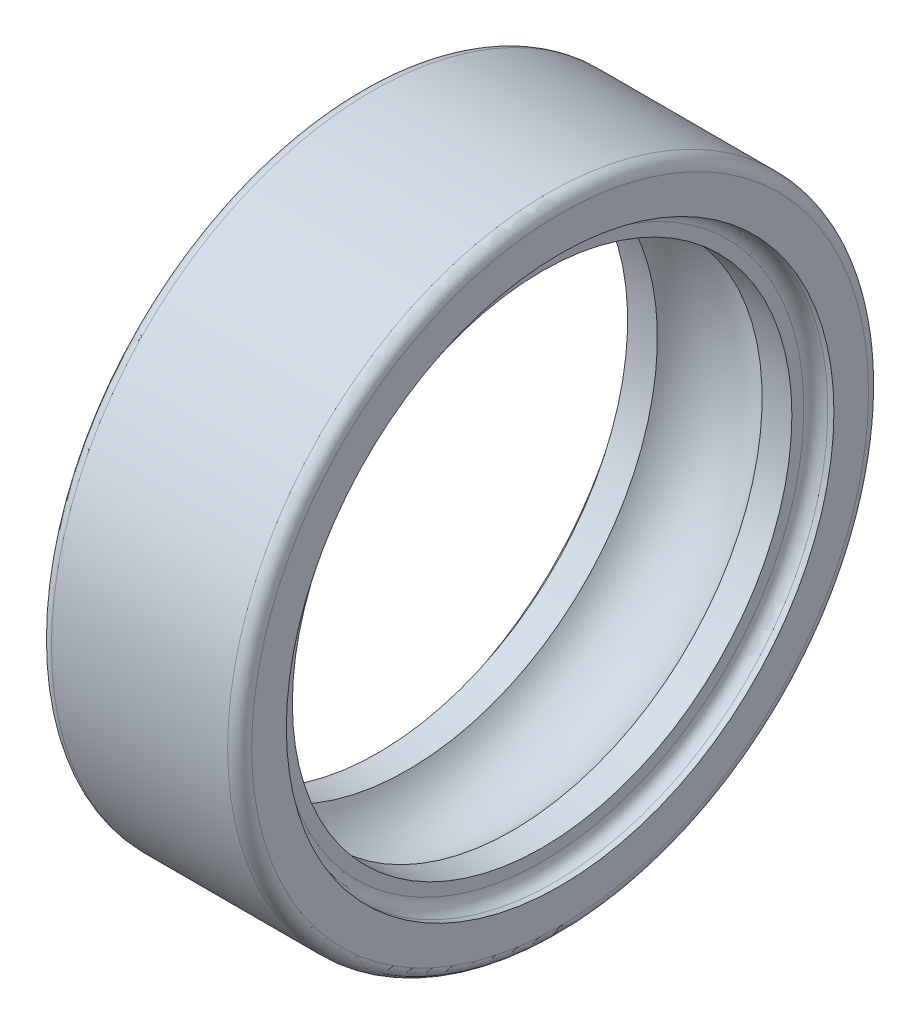
ISO-10303-21;
HEADER;
FILE_DESCRIPTION(('STEP AP214'),'2;1');
FILE_NAME('part.step','',(''),(''),'','','');
FILE_SCHEMA(('AUTOMOTIVE_DESIGN { 1 0 10303 214 1 1 1 1 }'));
ENDSEC;
DATA;
#1=APPLICATION_CONTEXT('core data for automotive mechanical design processes');
#2=APPLICATION_PROTOCOL_DEFINITION('international standard','automotive_design',2000,#1);
#3=PRODUCT_CONTEXT('',#1,'mechanical');
#4=PRODUCT('Part','Part','',(#3));
#5=PRODUCT_RELATED_PRODUCT_CATEGORY('part','',(#4));
#6=PRODUCT_DEFINITION_FORMATION('','',#4);
#7=PRODUCT_DEFINITION_CONTEXT('part definition',#1,'design');
#8=PRODUCT_DEFINITION('design','',#6,#7);
#9=PRODUCT_DEFINITION_SHAPE('','',#8);
#10=(LENGTH_UNIT() NAMED_UNIT(*) SI_UNIT(.MILLI.,.METRE.));
#11=(NAMED_UNIT(*) PLANE_ANGLE_UNIT() SI_UNIT($,.RADIAN.));
#12=(NAMED_UNIT(*) SI_UNIT($,.STERADIAN.) SOLID_ANGLE_UNIT());
#13=UNCERTAINTY_MEASURE_WITH_UNIT(LENGTH_MEASURE(1.E-05),#10,'distance_accuracy_value','');
#14=(GEOMETRIC_REPRESENTATION_CONTEXT(3) GLOBAL_UNCERTAINTY_ASSIGNED_CONTEXT((#13)) GLOBAL_UNIT_ASSIGNED_CONTEXT((#10,
#11,#12)) REPRESENTATION_CONTEXT('',''));
#15=CARTESIAN_POINT('',(0.,0.,0.));
#16=DIRECTION('',(0.,0.,1.));
#17=DIRECTION('',(1.,0.,0.));
#18=AXIS2_PLACEMENT_3D('',#15,#16,#17);
#19=CARTESIAN_POINT('',(0.,-15.6860756936389,-15.4));
#20=DIRECTION('',(-1.,0.,0.));
#21=DIRECTION('',(0.,0.,1.));
#22=AXIS2_PLACEMENT_3D('',#19,#20,#21);
#23=PLANE('',#22);
#24=CARTESIAN_POINT('',(0.,0.,0.));
#25=DIRECTION('',(-1.,0.,0.));
#26=DIRECTION('',(0.,0.,-1.));
#27=AXIS2_PLACEMENT_3D('',#24,#25,#26);
#28=CIRCLE('',#27,15.4000000346272);
#29=CARTESIAN_POINT('',(0.,0.,-15.4000000346272));
#30=VERTEX_POINT('',#29);
#31=EDGE_CURVE('E62',#30,#30,#28,.F.);
#32=ORIENTED_EDGE('',*,*,#31,.F.);
#33=EDGE_LOOP('',(#32));
#34=FACE_BOUND('',#33,.T.);
#35=CARTESIAN_POINT('',(0.,0.,0.));
#36=DIRECTION('',(1.,0.,0.));
#37=DIRECTION('',(0.,-1.16847960227371E-09,1.));
#38=AXIS2_PLACEMENT_3D('',#35,#36,#37);
#39=CIRCLE('',#38,13.67);
#40=CARTESIAN_POINT('',(0.,-1.59731161630816E-08,13.67));
#41=VERTEX_POINT('',#40);
#42=EDGE_CURVE('E59',#41,#41,#39,.T.);
#43=ORIENTED_EDGE('',*,*,#42,.T.);
#44=EDGE_LOOP('',(#43));
#45=FACE_BOUND('',#44,.T.);
#46=ADVANCED_FACE('F15',(#34,#45),#23,.T.);
#47=CARTESIAN_POINT('',(0.9,-13.3127928127182,-13.07));
#48=DIRECTION('',(-1.,0.,0.));
#49=DIRECTION('',(0.,0.,1.));
#50=AXIS2_PLACEMENT_3D('',#47,#48,#49);
#51=PLANE('',#50);
#52=CARTESIAN_POINT('',(0.9,0.,0.));
#53=DIRECTION('',(-1.,0.,0.));
#54=DIRECTION('',(0.,0.,-1.));
#55=AXIS2_PLACEMENT_3D('',#52,#53,#54);
#56=CIRCLE('',#55,13.0700000419357);
#57=CARTESIAN_POINT('',(0.9,0.,-13.0700000419357));
#58=VERTEX_POINT('',#57);
#59=EDGE_CURVE('E56',#58,#58,#56,.F.);
#60=ORIENTED_EDGE('',*,*,#59,.F.);
#61=EDGE_LOOP('',(#60));
#62=FACE_BOUND('',#61,.T.);
#63=CARTESIAN_POINT('',(0.9,0.,0.));
#64=DIRECTION('',(1.,0.,0.));
#65=DIRECTION('',(0.,-1.16838624670305E-09,1.));
#66=AXIS2_PLACEMENT_3D('',#63,#64,#65);
#67=CIRCLE('',#66,12.47);
#68=CARTESIAN_POINT('',(0.9,-1.4569776496387E-08,12.47));
#69=VERTEX_POINT('',#68);
#70=EDGE_CURVE('E53',#69,#69,#67,.T.);
#71=ORIENTED_EDGE('',*,*,#70,.T.);
#72=EDGE_LOOP('',(#71));
#73=FACE_BOUND('',#72,.T.);
#74=ADVANCED_FACE('F71',(#62,#73),#51,.T.);
#75=CARTESIAN_POINT('',(9.1,-13.3127927899784,13.07));
#76=DIRECTION('',(1.,0.,0.));
#77=DIRECTION('',(0.,0.,-1.));
#78=AXIS2_PLACEMENT_3D('',#75,#76,#77);
#79=PLANE('',#78);
#80=CARTESIAN_POINT('',(9.1,0.,0.));
#81=DIRECTION('',(1.,0.,0.));
#82=DIRECTION('',(0.,-1.1685467861558E-09,1.));
#83=AXIS2_PLACEMENT_3D('',#80,#81,#82);
#84=CIRCLE('',#83,13.07);
#85=CARTESIAN_POINT('',(9.1,-1.52729064950563E-08,13.07));
#86=VERTEX_POINT('',#85);
#87=EDGE_CURVE('E50',#86,#86,#84,.T.);
#88=ORIENTED_EDGE('',*,*,#87,.T.);
#89=EDGE_LOOP('',(#88));
#90=FACE_BOUND('',#89,.T.);
#91=CARTESIAN_POINT('',(9.1,0.,0.));
#92=DIRECTION('',(-1.,0.,0.));
#93=DIRECTION('',(0.,0.,-1.));
#94=AXIS2_PLACEMENT_3D('',#91,#92,#93);
#95=CIRCLE('',#94,12.47);
#96=CARTESIAN_POINT('',(9.1,0.,-12.47));
#97=VERTEX_POINT('',#96);
#98=EDGE_CURVE('E47',#97,#97,#95,.F.);
#99=ORIENTED_EDGE('',*,*,#98,.F.);
#100=EDGE_LOOP('',(#99));
#101=FACE_BOUND('',#100,.T.);
#102=ADVANCED_FACE('F121',(#90,#101),#79,.T.);
#103=CARTESIAN_POINT('',(10.,-15.6860756936389,15.4));
#104=DIRECTION('',(1.,0.,0.));
#105=DIRECTION('',(0.,0.,-1.));
#106=AXIS2_PLACEMENT_3D('',#103,#104,#105);
#107=PLANE('',#106);
#108=CARTESIAN_POINT('',(10.,0.,0.));
#109=DIRECTION('',(1.,0.,0.));
#110=DIRECTION('',(0.,0.,1.));
#111=AXIS2_PLACEMENT_3D('',#108,#109,#110);
#112=CIRCLE('',#111,15.4);
#113=CARTESIAN_POINT('',(10.,0.,15.4));
#114=VERTEX_POINT('',#113);
#115=EDGE_CURVE('E44',#114,#114,#112,.T.);
#116=ORIENTED_EDGE('',*,*,#115,.T.);
#117=EDGE_LOOP('',(#116));
#118=FACE_BOUND('',#117,.T.);
#119=CARTESIAN_POINT('',(10.,0.,0.));
#120=DIRECTION('',(-1.,0.,0.));
#121=DIRECTION('',(0.,0.,-1.));
#122=AXIS2_PLACEMENT_3D('',#119,#120,#121);
#123=CIRCLE('',#122,13.67);
#124=CARTESIAN_POINT('',(10.,0.,-13.67));
#125=VERTEX_POINT('',#124);
#126=EDGE_CURVE('E41',#125,#125,#123,.F.);
#127=ORIENTED_EDGE('',*,*,#126,.F.);
#128=EDGE_LOOP('',(#127));
#129=FACE_BOUND('',#128,.T.);
#130=ADVANCED_FACE('F88',(#118,#129),#107,.T.);
#131=CARTESIAN_POINT('',(0.599999999999872,0.,0.));
#132=DIRECTION('',(1.,0.,0.));
#133=DIRECTION('',(0.,1.92328942001804E-10,1.));
#134=AXIS2_PLACEMENT_3D('',#131,#132,#133);
#135=TOROIDAL_SURFACE('',#134,15.4,0.599999999999873);
#136=ORIENTED_EDGE('',*,*,#31,.T.);
#137=EDGE_LOOP('',(#136));
#138=FACE_BOUND('',#137,.T.);
#139=CARTESIAN_POINT('',(0.599999999999872,0.,0.));
#140=DIRECTION('',(-1.,0.,0.));
#141=DIRECTION('',(0.,0.,-1.));
#142=AXIS2_PLACEMENT_3D('',#139,#140,#141);
#143=CIRCLE('',#142,15.9999999999999);
#144=CARTESIAN_POINT('',(0.599999999999872,0.,-15.9999999999999));
#145=VERTEX_POINT('',#144);
#146=EDGE_CURVE('E38',#145,#145,#143,.F.);
#147=ORIENTED_EDGE('',*,*,#146,.F.);
#148=EDGE_LOOP('',(#147));
#149=FACE_BOUND('',#148,.T.);
#150=ADVANCED_FACE('F66',(#138,#149),#135,.T.);
#151=CARTESIAN_POINT('',(50.,0.,0.));
#152=DIRECTION('',(1.,0.,0.));
#153=DIRECTION('',(0.,0.,1.));
#154=AXIS2_PLACEMENT_3D('',#151,#152,#153);
#155=CYLINDRICAL_SURFACE('',#154,13.67);
#156=CARTESIAN_POINT('',(0.299999999999997,0.,0.));
#157=DIRECTION('',(1.,0.,0.));
#158=DIRECTION('',(0.,0.,1.));
#159=AXIS2_PLACEMENT_3D('',#156,#157,#158);
#160=CIRCLE('',#159,13.67);
#161=CARTESIAN_POINT('',(0.299999999999997,0.,13.67));
#162=VERTEX_POINT('',#161);
#163=EDGE_CURVE('E35',#162,#162,#160,.T.);
#164=ORIENTED_EDGE('',*,*,#163,.T.);
#165=EDGE_LOOP('',(#164));
#166=FACE_BOUND('',#165,.T.);
#167=ORIENTED_EDGE('',*,*,#42,.F.);
#168=EDGE_LOOP('',(#167));
#169=FACE_BOUND('',#168,.T.);
#170=ADVANCED_FACE('F75',(#166,#169),#155,.F.);
#171=CARTESIAN_POINT('',(0.300000000000125,0.,0.));
#172=DIRECTION('',(1.,0.,0.));
#173=DIRECTION('',(0.,0.,1.));
#174=AXIS2_PLACEMENT_3D('',#171,#172,#173);
#175=TOROIDAL_SURFACE('',#174,13.0700000000001,0.599999999999877);
#176=ORIENTED_EDGE('',*,*,#59,.T.);
#177=EDGE_LOOP('',(#176));
#178=FACE_BOUND('',#177,.T.);
#179=ORIENTED_EDGE('',*,*,#163,.F.);
#180=EDGE_LOOP('',(#179));
#181=FACE_BOUND('',#180,.T.);
#182=ADVANCED_FACE('F77',(#178,#181),#175,.F.);
#183=CARTESIAN_POINT('',(50.,0.,0.));
#184=DIRECTION('',(1.,0.,0.));
#185=DIRECTION('',(0.,0.,1.));
#186=AXIS2_PLACEMENT_3D('',#183,#184,#185);
#187=CYLINDRICAL_SURFACE('',#186,12.47);
#188=CARTESIAN_POINT('',(2.3848327013363,0.,0.));
#189=DIRECTION('',(1.,0.,0.));
#190=DIRECTION('',(0.,0.,1.));
#191=AXIS2_PLACEMENT_3D('',#188,#189,#190);
#192=CIRCLE('',#191,12.47);
#193=CARTESIAN_POINT('',(2.3848327013363,0.,12.47));
#194=VERTEX_POINT('',#193);
#195=EDGE_CURVE('E30',#194,#194,#192,.T.);
#196=ORIENTED_EDGE('',*,*,#195,.T.);
#197=EDGE_LOOP('',(#196));
#198=FACE_BOUND('',#197,.T.);
#199=ORIENTED_EDGE('',*,*,#70,.F.);
#200=EDGE_LOOP('',(#199));
#201=FACE_BOUND('',#200,.T.);
#202=ADVANCED_FACE('F85',(#198,#201),#187,.F.);
#203=CARTESIAN_POINT('',(5.,0.,0.));
#204=DIRECTION('',(1.,0.,0.));
#205=DIRECTION('',(0.,0.,1.));
#206=AXIS2_PLACEMENT_3D('',#203,#204,#205);
#207=TOROIDAL_SURFACE('',#206,11.,3.);
#208=ORIENTED_EDGE('',*,*,#195,.F.);
#209=EDGE_LOOP('',(#208));
#210=FACE_BOUND('',#209,.T.);
#211=CARTESIAN_POINT('',(7.6151672986637,0.,0.));
#212=DIRECTION('',(1.,0.,0.));
#213=DIRECTION('',(0.,0.,1.));
#214=AXIS2_PLACEMENT_3D('',#211,#212,#213);
#215=CIRCLE('',#214,12.47);
#216=CARTESIAN_POINT('',(7.6151672986637,0.,12.47));
#217=VERTEX_POINT('',#216);
#218=EDGE_CURVE('E26',#217,#217,#215,.T.);
#219=ORIENTED_EDGE('',*,*,#218,.T.);
#220=EDGE_LOOP('',(#219));
#221=FACE_BOUND('',#220,.T.);
#222=ADVANCED_FACE('F94',(#210,#221),#207,.F.);
#223=CARTESIAN_POINT('',(50.,0.,0.));
#224=DIRECTION('',(1.,0.,0.));
#225=DIRECTION('',(0.,0.,1.));
#226=AXIS2_PLACEMENT_3D('',#223,#224,#225);
#227=CYLINDRICAL_SURFACE('',#226,12.47);
#228=ORIENTED_EDGE('',*,*,#98,.T.);
#229=EDGE_LOOP('',(#228));
#230=FACE_BOUND('',#229,.T.);
#231=ORIENTED_EDGE('',*,*,#218,.F.);
#232=EDGE_LOOP('',(#231));
#233=FACE_BOUND('',#232,.T.);
#234=ADVANCED_FACE('F98',(#230,#233),#227,.F.);
#235=CARTESIAN_POINT('',(9.7,0.,0.));
#236=DIRECTION('',(1.,0.,0.));
#237=DIRECTION('',(0.,0.,1.));
#238=AXIS2_PLACEMENT_3D('',#235,#236,#237);
#239=TOROIDAL_SURFACE('',#238,13.07,0.599999999999929);
#240=ORIENTED_EDGE('',*,*,#87,.F.);
#241=EDGE_LOOP('',(#240));
#242=FACE_BOUND('',#241,.T.);
#243=CARTESIAN_POINT('',(9.7,0.,0.));
#244=DIRECTION('',(1.,0.,0.));
#245=DIRECTION('',(0.,0.,1.));
#246=AXIS2_PLACEMENT_3D('',#243,#244,#245);
#247=CIRCLE('',#246,13.6699999999999);
#248=CARTESIAN_POINT('',(9.7,0.,13.6699999999999));
#249=VERTEX_POINT('',#248);
#250=EDGE_CURVE('E22',#249,#249,#247,.T.);
#251=ORIENTED_EDGE('',*,*,#250,.T.);
#252=EDGE_LOOP('',(#251));
#253=FACE_BOUND('',#252,.T.);
#254=ADVANCED_FACE('F102',(#242,#253),#239,.F.);
#255=CARTESIAN_POINT('',(50.,0.,0.));
#256=DIRECTION('',(1.,0.,0.));
#257=DIRECTION('',(0.,0.,1.));
#258=AXIS2_PLACEMENT_3D('',#255,#256,#257);
#259=CYLINDRICAL_SURFACE('',#258,13.67);
#260=ORIENTED_EDGE('',*,*,#126,.T.);
#261=EDGE_LOOP('',(#260));
#262=FACE_BOUND('',#261,.T.);
#263=ORIENTED_EDGE('',*,*,#250,.F.);
#264=EDGE_LOOP('',(#263));
#265=FACE_BOUND('',#264,.T.);
#266=ADVANCED_FACE('F106',(#262,#265),#259,.F.);
#267=CARTESIAN_POINT('',(9.4,0.,0.));
#268=DIRECTION('',(1.,0.,0.));
#269=DIRECTION('',(0.,0.,1.));
#270=AXIS2_PLACEMENT_3D('',#267,#268,#269);
#271=TOROIDAL_SURFACE('',#270,15.4,0.599999999999922);
#272=CARTESIAN_POINT('',(9.4,0.,0.));
#273=DIRECTION('',(1.,0.,0.));
#274=DIRECTION('',(0.,0.,1.));
#275=AXIS2_PLACEMENT_3D('',#272,#273,#274);
#276=CIRCLE('',#275,15.9999999999999);
#277=CARTESIAN_POINT('',(9.4,0.,15.9999999999999));
#278=VERTEX_POINT('',#277);
#279=EDGE_CURVE('E10',#278,#278,#276,.T.);
#280=ORIENTED_EDGE('',*,*,#279,.T.);
#281=EDGE_LOOP('',(#280));
#282=FACE_BOUND('',#281,.T.);
#283=ORIENTED_EDGE('',*,*,#115,.F.);
#284=EDGE_LOOP('',(#283));
#285=FACE_BOUND('',#284,.T.);
#286=ADVANCED_FACE('F109',(#282,#285),#271,.T.);
#287=CARTESIAN_POINT('',(50.,0.,0.));
#288=DIRECTION('',(1.,0.,0.));
#289=DIRECTION('',(0.,1.92328942001804E-10,1.));
#290=AXIS2_PLACEMENT_3D('',#287,#288,#289);
#291=CYLINDRICAL_SURFACE('',#290,16.);
#292=ORIENTED_EDGE('',*,*,#146,.T.);
#293=EDGE_LOOP('',(#292));
#294=FACE_BOUND('',#293,.T.);
#295=ORIENTED_EDGE('',*,*,#279,.F.);
#296=EDGE_LOOP('',(#295));
#297=FACE_BOUND('',#296,.T.);
#298=ADVANCED_FACE('F17',(#294,#297),#291,.T.);
#299=CLOSED_SHELL('',(#46,#74,#102,#130,#150,#170,#182,#202,#222,#234,#254,#266,#286,#298));
#300=MANIFOLD_SOLID_BREP('B1',#299);
#301=ADVANCED_BREP_SHAPE_REPRESENTATION('',(#18,#300),#14);
#302=SHAPE_DEFINITION_REPRESENTATION(#9,#301);
ENDSEC;
END-ISO-10303-21;
